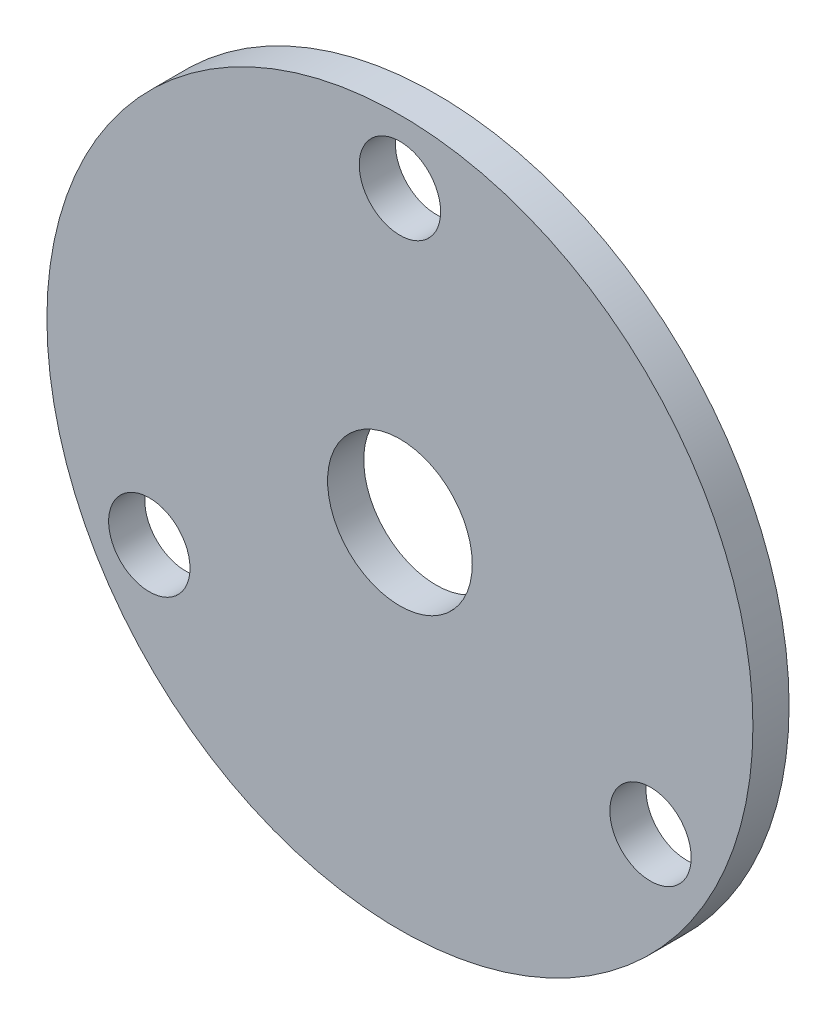
ISO-10303-21;
HEADER;
FILE_DESCRIPTION(('STEP AP214'),'2;1');
FILE_NAME('part.step','',(''),(''),'','','');
FILE_SCHEMA(('AUTOMOTIVE_DESIGN { 1 0 10303 214 1 1 1 1 }'));
ENDSEC;
DATA;
#1=APPLICATION_CONTEXT('core data for automotive mechanical design processes');
#2=APPLICATION_PROTOCOL_DEFINITION('international standard','automotive_design',2000,#1);
#3=PRODUCT_CONTEXT('',#1,'mechanical');
#4=PRODUCT('Part','Part','',(#3));
#5=PRODUCT_RELATED_PRODUCT_CATEGORY('part','',(#4));
#6=PRODUCT_DEFINITION_FORMATION('','',#4);
#7=PRODUCT_DEFINITION_CONTEXT('part definition',#1,'design');
#8=PRODUCT_DEFINITION('design','',#6,#7);
#9=PRODUCT_DEFINITION_SHAPE('','',#8);
#10=(LENGTH_UNIT() NAMED_UNIT(*) SI_UNIT(.MILLI.,.METRE.));
#11=(NAMED_UNIT(*) PLANE_ANGLE_UNIT() SI_UNIT($,.RADIAN.));
#12=(NAMED_UNIT(*) SI_UNIT($,.STERADIAN.) SOLID_ANGLE_UNIT());
#13=UNCERTAINTY_MEASURE_WITH_UNIT(LENGTH_MEASURE(1.E-05),#10,'distance_accuracy_value','');
#14=(GEOMETRIC_REPRESENTATION_CONTEXT(3) GLOBAL_UNCERTAINTY_ASSIGNED_CONTEXT((#13)) GLOBAL_UNIT_ASSIGNED_CONTEXT((#10,
#11,#12)) REPRESENTATION_CONTEXT('',''));
#15=CARTESIAN_POINT('',(0.,0.,0.));
#16=DIRECTION('',(0.,0.,1.));
#17=DIRECTION('',(1.,0.,0.));
#18=AXIS2_PLACEMENT_3D('',#15,#16,#17);
#19=CARTESIAN_POINT('',(0.,0.,6.35));
#20=DIRECTION('',(0.,0.,-1.));
#21=DIRECTION('',(-1.,0.,0.));
#22=AXIS2_PLACEMENT_3D('',#19,#20,#21);
#23=CYLINDRICAL_SURFACE('',#22,61.976);
#24=CARTESIAN_POINT('',(0.,0.,6.35));
#25=DIRECTION('',(0.,0.,1.));
#26=DIRECTION('',(1.,0.,0.));
#27=AXIS2_PLACEMENT_3D('',#24,#25,#26);
#28=CIRCLE('',#27,61.976);
#29=CARTESIAN_POINT('',(61.976,0.,6.35));
#30=VERTEX_POINT('',#29);
#31=EDGE_CURVE('E12',#30,#30,#28,.T.);
#32=ORIENTED_EDGE('',*,*,#31,.F.);
#33=EDGE_LOOP('',(#32));
#34=FACE_BOUND('',#33,.T.);
#35=CARTESIAN_POINT('',(0.,0.,0.));
#36=DIRECTION('',(0.,0.,1.));
#37=DIRECTION('',(1.,0.,0.));
#38=AXIS2_PLACEMENT_3D('',#35,#36,#37);
#39=CIRCLE('',#38,61.976);
#40=CARTESIAN_POINT('',(61.976,0.,0.));
#41=VERTEX_POINT('',#40);
#42=EDGE_CURVE('E46',#41,#41,#39,.T.);
#43=ORIENTED_EDGE('',*,*,#42,.T.);
#44=EDGE_LOOP('',(#43));
#45=FACE_BOUND('',#44,.T.);
#46=ADVANCED_FACE('F43',(#34,#45),#23,.T.);
#47=CARTESIAN_POINT('',(0.,0.,6.35));
#48=DIRECTION('',(0.,0.,1.));
#49=DIRECTION('',(1.,0.,0.));
#50=AXIS2_PLACEMENT_3D('',#47,#48,#49);
#51=PLANE('',#50);
#52=CARTESIAN_POINT('',(-43.9940905122495,-25.3999999999999,6.35));
#53=DIRECTION('',(0.,0.,1.));
#54=DIRECTION('',(1.,0.,0.));
#55=AXIS2_PLACEMENT_3D('',#52,#53,#54);
#56=CIRCLE('',#55,7.14375);
#57=CARTESIAN_POINT('',(-36.8503405122495,-25.3999999999999,6.35));
#58=VERTEX_POINT('',#57);
#59=EDGE_CURVE('E75',#58,#58,#56,.T.);
#60=ORIENTED_EDGE('',*,*,#59,.F.);
#61=EDGE_LOOP('',(#60));
#62=FACE_BOUND('',#61,.T.);
#63=CARTESIAN_POINT('',(43.9940905122494,-25.4000000000002,6.35));
#64=DIRECTION('',(0.,0.,1.));
#65=DIRECTION('',(1.,0.,0.));
#66=AXIS2_PLACEMENT_3D('',#63,#64,#65);
#67=CIRCLE('',#66,7.14375);
#68=CARTESIAN_POINT('',(51.1378405122494,-25.4000000000002,6.35));
#69=VERTEX_POINT('',#68);
#70=EDGE_CURVE('E69',#69,#69,#67,.T.);
#71=ORIENTED_EDGE('',*,*,#70,.F.);
#72=EDGE_LOOP('',(#71));
#73=FACE_BOUND('',#72,.T.);
#74=CARTESIAN_POINT('',(0.,50.8,6.35));
#75=DIRECTION('',(0.,0.,1.));
#76=DIRECTION('',(1.,0.,0.));
#77=AXIS2_PLACEMENT_3D('',#74,#75,#76);
#78=CIRCLE('',#77,7.14375);
#79=CARTESIAN_POINT('',(7.14375,50.8,6.35));
#80=VERTEX_POINT('',#79);
#81=EDGE_CURVE('E63',#80,#80,#78,.T.);
#82=ORIENTED_EDGE('',*,*,#81,.F.);
#83=EDGE_LOOP('',(#82));
#84=FACE_BOUND('',#83,.T.);
#85=CARTESIAN_POINT('',(0.,0.,6.35));
#86=DIRECTION('',(0.,0.,1.));
#87=DIRECTION('',(1.,0.,0.));
#88=AXIS2_PLACEMENT_3D('',#85,#86,#87);
#89=CIRCLE('',#88,12.7);
#90=CARTESIAN_POINT('',(12.7,0.,6.35));
#91=VERTEX_POINT('',#90);
#92=EDGE_CURVE('E57',#91,#91,#89,.T.);
#93=ORIENTED_EDGE('',*,*,#92,.F.);
#94=EDGE_LOOP('',(#93));
#95=FACE_BOUND('',#94,.T.);
#96=ORIENTED_EDGE('',*,*,#31,.T.);
#97=EDGE_LOOP('',(#96));
#98=FACE_BOUND('',#97,.T.);
#99=ADVANCED_FACE('F81',(#62,#73,#84,#95,#98),#51,.T.);
#100=CARTESIAN_POINT('',(0.,0.,0.));
#101=DIRECTION('',(0.,0.,1.));
#102=DIRECTION('',(1.,0.,0.));
#103=AXIS2_PLACEMENT_3D('',#100,#101,#102);
#104=PLANE('',#103);
#105=CARTESIAN_POINT('',(-43.9940905122495,-25.3999999999999,0.));
#106=DIRECTION('',(0.,0.,1.));
#107=DIRECTION('',(1.,0.,0.));
#108=AXIS2_PLACEMENT_3D('',#105,#106,#107);
#109=CIRCLE('',#108,7.14375);
#110=CARTESIAN_POINT('',(-36.8503405122495,-25.3999999999999,0.));
#111=VERTEX_POINT('',#110);
#112=EDGE_CURVE('E72',#111,#111,#109,.T.);
#113=ORIENTED_EDGE('',*,*,#112,.T.);
#114=EDGE_LOOP('',(#113));
#115=FACE_BOUND('',#114,.T.);
#116=CARTESIAN_POINT('',(43.9940905122494,-25.4000000000002,0.));
#117=DIRECTION('',(0.,0.,1.));
#118=DIRECTION('',(1.,0.,0.));
#119=AXIS2_PLACEMENT_3D('',#116,#117,#118);
#120=CIRCLE('',#119,7.14375);
#121=CARTESIAN_POINT('',(51.1378405122494,-25.4000000000002,0.));
#122=VERTEX_POINT('',#121);
#123=EDGE_CURVE('E66',#122,#122,#120,.T.);
#124=ORIENTED_EDGE('',*,*,#123,.T.);
#125=EDGE_LOOP('',(#124));
#126=FACE_BOUND('',#125,.T.);
#127=CARTESIAN_POINT('',(0.,50.8,0.));
#128=DIRECTION('',(0.,0.,1.));
#129=DIRECTION('',(1.,0.,0.));
#130=AXIS2_PLACEMENT_3D('',#127,#128,#129);
#131=CIRCLE('',#130,7.14375);
#132=CARTESIAN_POINT('',(7.14375,50.8,0.));
#133=VERTEX_POINT('',#132);
#134=EDGE_CURVE('E60',#133,#133,#131,.T.);
#135=ORIENTED_EDGE('',*,*,#134,.T.);
#136=EDGE_LOOP('',(#135));
#137=FACE_BOUND('',#136,.T.);
#138=CARTESIAN_POINT('',(0.,0.,0.));
#139=DIRECTION('',(0.,0.,1.));
#140=DIRECTION('',(1.,0.,0.));
#141=AXIS2_PLACEMENT_3D('',#138,#139,#140);
#142=CIRCLE('',#141,12.7);
#143=CARTESIAN_POINT('',(12.7,0.,0.));
#144=VERTEX_POINT('',#143);
#145=EDGE_CURVE('E53',#144,#144,#142,.T.);
#146=ORIENTED_EDGE('',*,*,#145,.T.);
#147=EDGE_LOOP('',(#146));
#148=FACE_BOUND('',#147,.T.);
#149=ORIENTED_EDGE('',*,*,#42,.F.);
#150=EDGE_LOOP('',(#149));
#151=FACE_BOUND('',#150,.T.);
#152=ADVANCED_FACE('F84',(#115,#126,#137,#148,#151),#104,.F.);
#153=CARTESIAN_POINT('',(0.,0.,6.35));
#154=DIRECTION('',(0.,0.,1.));
#155=DIRECTION('',(1.,0.,0.));
#156=AXIS2_PLACEMENT_3D('',#153,#154,#155);
#157=CYLINDRICAL_SURFACE('',#156,12.7);
#158=ORIENTED_EDGE('',*,*,#145,.F.);
#159=EDGE_LOOP('',(#158));
#160=FACE_BOUND('',#159,.T.);
#161=ORIENTED_EDGE('',*,*,#92,.T.);
#162=EDGE_LOOP('',(#161));
#163=FACE_BOUND('',#162,.T.);
#164=ADVANCED_FACE('F92',(#160,#163),#157,.F.);
#165=CARTESIAN_POINT('',(0.,50.8,6.35));
#166=DIRECTION('',(0.,0.,1.));
#167=DIRECTION('',(1.,0.,0.));
#168=AXIS2_PLACEMENT_3D('',#165,#166,#167);
#169=CYLINDRICAL_SURFACE('',#168,7.14375);
#170=ORIENTED_EDGE('',*,*,#134,.F.);
#171=EDGE_LOOP('',(#170));
#172=FACE_BOUND('',#171,.T.);
#173=ORIENTED_EDGE('',*,*,#81,.T.);
#174=EDGE_LOOP('',(#173));
#175=FACE_BOUND('',#174,.T.);
#176=ADVANCED_FACE('F94',(#172,#175),#169,.F.);
#177=CARTESIAN_POINT('',(43.9940905122494,-25.4000000000002,6.35));
#178=DIRECTION('',(0.,0.,1.));
#179=DIRECTION('',(1.,0.,0.));
#180=AXIS2_PLACEMENT_3D('',#177,#178,#179);
#181=CYLINDRICAL_SURFACE('',#180,7.14375);
#182=ORIENTED_EDGE('',*,*,#123,.F.);
#183=EDGE_LOOP('',(#182));
#184=FACE_BOUND('',#183,.T.);
#185=ORIENTED_EDGE('',*,*,#70,.T.);
#186=EDGE_LOOP('',(#185));
#187=FACE_BOUND('',#186,.T.);
#188=ADVANCED_FACE('F101',(#184,#187),#181,.F.);
#189=CARTESIAN_POINT('',(-43.9940905122495,-25.3999999999999,6.35));
#190=DIRECTION('',(0.,0.,1.));
#191=DIRECTION('',(1.,0.,0.));
#192=AXIS2_PLACEMENT_3D('',#189,#190,#191);
#193=CYLINDRICAL_SURFACE('',#192,7.14375);
#194=ORIENTED_EDGE('',*,*,#112,.F.);
#195=EDGE_LOOP('',(#194));
#196=FACE_BOUND('',#195,.T.);
#197=ORIENTED_EDGE('',*,*,#59,.T.);
#198=EDGE_LOOP('',(#197));
#199=FACE_BOUND('',#198,.T.);
#200=ADVANCED_FACE('F79',(#196,#199),#193,.F.);
#201=CLOSED_SHELL('',(#46,#99,#152,#164,#176,#188,#200));
#202=MANIFOLD_SOLID_BREP('B2',#201);
#203=ADVANCED_BREP_SHAPE_REPRESENTATION('',(#18,#202),#14);
#204=SHAPE_DEFINITION_REPRESENTATION(#9,#203);
ENDSEC;
END-ISO-10303-21;
